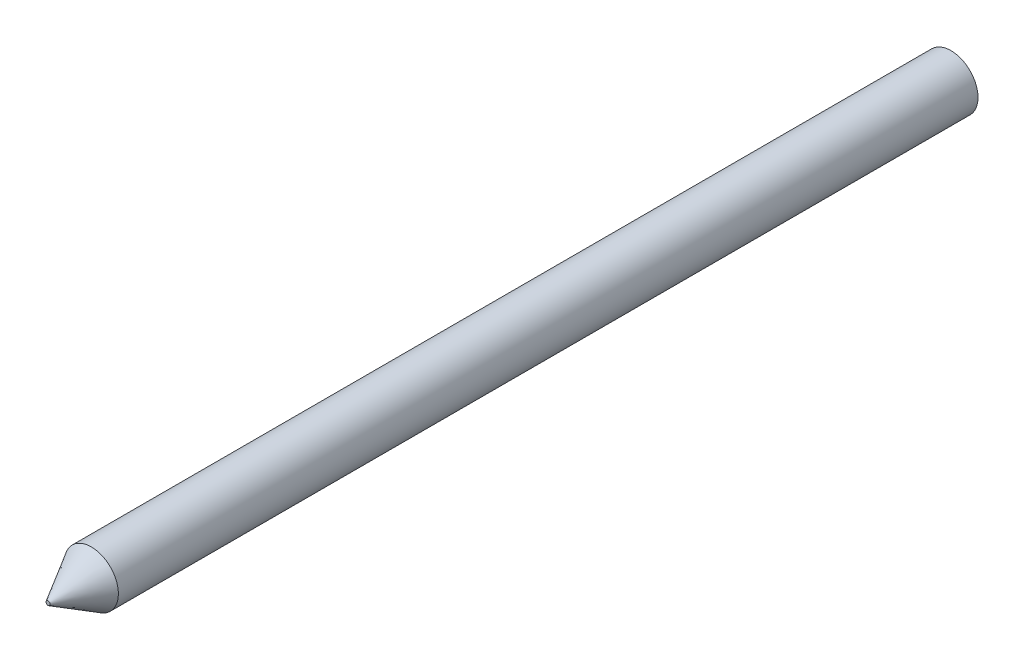
ISO-10303-21;
HEADER;
FILE_DESCRIPTION(('STEP AP214'),'2;1');
FILE_NAME('part.step','',(''),(''),'','','');
FILE_SCHEMA(('AUTOMOTIVE_DESIGN { 1 0 10303 214 1 1 1 1 }'));
ENDSEC;
DATA;
#1=APPLICATION_CONTEXT('core data for automotive mechanical design processes');
#2=APPLICATION_PROTOCOL_DEFINITION('international standard','automotive_design',2000,#1);
#3=PRODUCT_CONTEXT('',#1,'mechanical');
#4=PRODUCT('Part','Part','',(#3));
#5=PRODUCT_RELATED_PRODUCT_CATEGORY('part','',(#4));
#6=PRODUCT_DEFINITION_FORMATION('','',#4);
#7=PRODUCT_DEFINITION_CONTEXT('part definition',#1,'design');
#8=PRODUCT_DEFINITION('design','',#6,#7);
#9=PRODUCT_DEFINITION_SHAPE('','',#8);
#10=(LENGTH_UNIT() NAMED_UNIT(*) SI_UNIT(.MILLI.,.METRE.));
#11=(NAMED_UNIT(*) PLANE_ANGLE_UNIT() SI_UNIT($,.RADIAN.));
#12=(NAMED_UNIT(*) SI_UNIT($,.STERADIAN.) SOLID_ANGLE_UNIT());
#13=UNCERTAINTY_MEASURE_WITH_UNIT(LENGTH_MEASURE(1.E-05),#10,'distance_accuracy_value','');
#14=(GEOMETRIC_REPRESENTATION_CONTEXT(3) GLOBAL_UNCERTAINTY_ASSIGNED_CONTEXT((#13)) GLOBAL_UNIT_ASSIGNED_CONTEXT((#10,
#11,#12)) REPRESENTATION_CONTEXT('',''));
#15=CARTESIAN_POINT('',(0.,0.,0.));
#16=DIRECTION('',(0.,0.,1.));
#17=DIRECTION('',(1.,0.,0.));
#18=AXIS2_PLACEMENT_3D('',#15,#16,#17);
#19=CARTESIAN_POINT('',(-256.609003688228,7.7715611723761E-13,281.563203435596));
#20=DIRECTION('',(0.,0.,-1.));
#21=DIRECTION('',(-1.,0.,0.));
#22=AXIS2_PLACEMENT_3D('',#19,#20,#21);
#23=CYLINDRICAL_SURFACE('',#22,7.49999999999998);
#24=CARTESIAN_POINT('',(-256.609003688228,7.7715611723761E-13,238.35));
#25=DIRECTION('',(0.,0.,1.));
#26=DIRECTION('',(1.,0.,0.));
#27=AXIS2_PLACEMENT_3D('',#24,#25,#26);
#28=CIRCLE('',#27,7.49999999999998);
#29=CARTESIAN_POINT('',(-249.109003688228,7.7715611723761E-13,238.35));
#30=VERTEX_POINT('',#29);
#31=EDGE_CURVE('E11',#30,#30,#28,.F.);
#32=ORIENTED_EDGE('',*,*,#31,.T.);
#33=EDGE_LOOP('',(#32));
#34=FACE_BOUND('',#33,.T.);
#35=CARTESIAN_POINT('',(-256.609003688228,7.7715611723761E-13,0.));
#36=DIRECTION('',(0.,0.,1.));
#37=DIRECTION('',(1.,0.,0.));
#38=AXIS2_PLACEMENT_3D('',#35,#36,#37);
#39=CIRCLE('',#38,7.49999999999998);
#40=CARTESIAN_POINT('',(-249.109003688228,7.7715611723761E-13,0.));
#41=VERTEX_POINT('',#40);
#42=EDGE_CURVE('E46',#41,#41,#39,.T.);
#43=ORIENTED_EDGE('',*,*,#42,.T.);
#44=EDGE_LOOP('',(#43));
#45=FACE_BOUND('',#44,.T.);
#46=ADVANCED_FACE('F34',(#34,#45),#23,.T.);
#47=CARTESIAN_POINT('',(-256.609003688228,7.7715611723761E-13,0.));
#48=DIRECTION('',(0.,0.,1.));
#49=DIRECTION('',(1.,0.,0.));
#50=AXIS2_PLACEMENT_3D('',#47,#48,#49);
#51=PLANE('',#50);
#52=ORIENTED_EDGE('',*,*,#42,.F.);
#53=EDGE_LOOP('',(#52));
#54=FACE_BOUND('',#53,.T.);
#55=ADVANCED_FACE('F54',(#54),#51,.F.);
#56=CARTESIAN_POINT('',(233.341891350342,-322.242830404419,250.35));
#57=DIRECTION('',(0.,0.,1.));
#58=DIRECTION('',(-0.78122441871595,0.624250276413175,0.));
#59=AXIS2_PLACEMENT_3D('',#56,#57,#58);
#60=PLANE('',#59);
#61=CARTESIAN_POINT('',(-256.609003688228,7.7715611723761E-13,250.35));
#62=DIRECTION('',(0.,0.,1.));
#63=DIRECTION('',(1.,0.,0.));
#64=AXIS2_PLACEMENT_3D('',#61,#62,#63);
#65=CIRCLE('',#64,0.57179676972452);
#66=CARTESIAN_POINT('',(-256.037206918504,7.7715611723761E-13,250.35));
#67=VERTEX_POINT('',#66);
#68=EDGE_CURVE('E42',#67,#67,#65,.T.);
#69=ORIENTED_EDGE('',*,*,#68,.T.);
#70=EDGE_LOOP('',(#69));
#71=FACE_BOUND('',#70,.T.);
#72=ADVANCED_FACE('F56',(#71),#60,.T.);
#73=CARTESIAN_POINT('',(-256.609003688228,7.7715611723761E-13,250.35));
#74=DIRECTION('',(0.,0.,-1.));
#75=DIRECTION('',(-1.,0.,0.));
#76=AXIS2_PLACEMENT_3D('',#73,#74,#75);
#77=CONICAL_SURFACE('',#76,0.57179676972452,0.523598775598295);
#78=ORIENTED_EDGE('',*,*,#31,.F.);
#79=EDGE_LOOP('',(#78));
#80=FACE_BOUND('',#79,.T.);
#81=ORIENTED_EDGE('',*,*,#68,.F.);
#82=EDGE_LOOP('',(#81));
#83=FACE_BOUND('',#82,.T.);
#84=ADVANCED_FACE('F37',(#80,#83),#77,.T.);
#85=CLOSED_SHELL('',(#46,#55,#72,#84));
#86=MANIFOLD_SOLID_BREP('B2',#85);
#87=ADVANCED_BREP_SHAPE_REPRESENTATION('',(#18,#86),#14);
#88=SHAPE_DEFINITION_REPRESENTATION(#9,#87);
ENDSEC;
END-ISO-10303-21;
